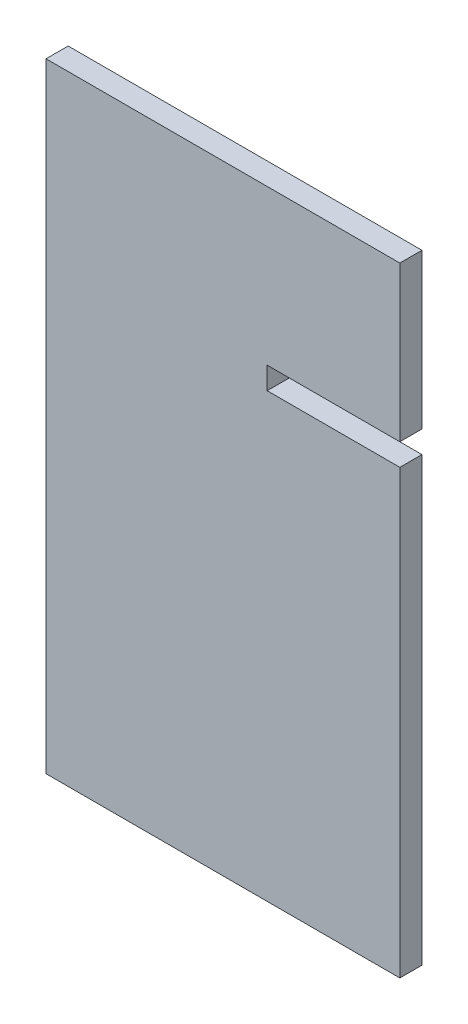
ISO-10303-21;
HEADER;
FILE_DESCRIPTION(('STEP AP214'),'2;1');
FILE_NAME('part.step','',(''),(''),'','','');
FILE_SCHEMA(('AUTOMOTIVE_DESIGN { 1 0 10303 214 1 1 1 1 }'));
ENDSEC;
DATA;
#1=APPLICATION_CONTEXT('core data for automotive mechanical design processes');
#2=APPLICATION_PROTOCOL_DEFINITION('international standard','automotive_design',2000,#1);
#3=PRODUCT_CONTEXT('',#1,'mechanical');
#4=PRODUCT('Part','Part','',(#3));
#5=PRODUCT_RELATED_PRODUCT_CATEGORY('part','',(#4));
#6=PRODUCT_DEFINITION_FORMATION('','',#4);
#7=PRODUCT_DEFINITION_CONTEXT('part definition',#1,'design');
#8=PRODUCT_DEFINITION('design','',#6,#7);
#9=PRODUCT_DEFINITION_SHAPE('','',#8);
#10=(LENGTH_UNIT() NAMED_UNIT(*) SI_UNIT(.MILLI.,.METRE.));
#11=(NAMED_UNIT(*) PLANE_ANGLE_UNIT() SI_UNIT($,.RADIAN.));
#12=(NAMED_UNIT(*) SI_UNIT($,.STERADIAN.) SOLID_ANGLE_UNIT());
#13=UNCERTAINTY_MEASURE_WITH_UNIT(LENGTH_MEASURE(1.E-05),#10,'distance_accuracy_value','');
#14=(GEOMETRIC_REPRESENTATION_CONTEXT(3) GLOBAL_UNCERTAINTY_ASSIGNED_CONTEXT((#13)) GLOBAL_UNIT_ASSIGNED_CONTEXT((#10,
#11,#12)) REPRESENTATION_CONTEXT('',''));
#15=CARTESIAN_POINT('',(0.,0.,0.));
#16=DIRECTION('',(0.,0.,1.));
#17=DIRECTION('',(1.,0.,0.));
#18=AXIS2_PLACEMENT_3D('',#15,#16,#17);
#19=CARTESIAN_POINT('',(0.,0.,5.));
#20=DIRECTION('',(1.,0.,0.));
#21=DIRECTION('',(0.,0.,-1.));
#22=AXIS2_PLACEMENT_3D('',#19,#20,#21);
#23=PLANE('',#22);
#24=DIRECTION('',(0.,-1.,0.));
#25=VECTOR('',#24,1.);
#26=CARTESIAN_POINT('',(0.,0.,0.));
#27=LINE('',#26,#25);
#28=CARTESIAN_POINT('',(0.,140.,0.));
#29=VERTEX_POINT('',#28);
#30=CARTESIAN_POINT('',(0.,0.,0.));
#31=VERTEX_POINT('',#30);
#32=EDGE_CURVE('E129',#29,#31,#27,.T.);
#33=ORIENTED_EDGE('',*,*,#32,.T.);
#34=DIRECTION('',(0.,0.,-1.));
#35=VECTOR('',#34,1.);
#36=CARTESIAN_POINT('',(0.,0.,5.));
#37=LINE('',#36,#35);
#38=CARTESIAN_POINT('',(0.,0.,5.));
#39=VERTEX_POINT('',#38);
#40=EDGE_CURVE('E11',#39,#31,#37,.T.);
#41=ORIENTED_EDGE('',*,*,#40,.F.);
#42=DIRECTION('',(0.,-1.,0.));
#43=VECTOR('',#42,1.);
#44=CARTESIAN_POINT('',(0.,0.,5.));
#45=LINE('',#44,#43);
#46=CARTESIAN_POINT('',(0.,140.,5.));
#47=VERTEX_POINT('',#46);
#48=EDGE_CURVE('E143',#47,#39,#45,.T.);
#49=ORIENTED_EDGE('',*,*,#48,.F.);
#50=DIRECTION('',(0.,0.,-1.));
#51=VECTOR('',#50,1.);
#52=CARTESIAN_POINT('',(0.,140.,5.));
#53=LINE('',#52,#51);
#54=EDGE_CURVE('E125',#47,#29,#53,.T.);
#55=ORIENTED_EDGE('',*,*,#54,.T.);
#56=EDGE_LOOP('',(#33,#41,#49,#55));
#57=FACE_BOUND('',#56,.T.);
#58=ADVANCED_FACE('F33',(#57),#23,.F.);
#59=CARTESIAN_POINT('',(0.,0.,5.));
#60=DIRECTION('',(0.,1.,0.));
#61=DIRECTION('',(0.,0.,1.));
#62=AXIS2_PLACEMENT_3D('',#59,#60,#61);
#63=PLANE('',#62);
#64=DIRECTION('',(1.,0.,0.));
#65=VECTOR('',#64,1.);
#66=CARTESIAN_POINT('',(0.,0.,0.));
#67=LINE('',#66,#65);
#68=CARTESIAN_POINT('',(80.,0.,0.));
#69=VERTEX_POINT('',#68);
#70=EDGE_CURVE('E132',#31,#69,#67,.T.);
#71=ORIENTED_EDGE('',*,*,#70,.T.);
#72=DIRECTION('',(0.,0.,-1.));
#73=VECTOR('',#72,1.);
#74=CARTESIAN_POINT('',(80.,0.,5.));
#75=LINE('',#74,#73);
#76=CARTESIAN_POINT('',(80.,0.,5.));
#77=VERTEX_POINT('',#76);
#78=EDGE_CURVE('E41',#77,#69,#75,.T.);
#79=ORIENTED_EDGE('',*,*,#78,.F.);
#80=DIRECTION('',(1.,0.,0.));
#81=VECTOR('',#80,1.);
#82=CARTESIAN_POINT('',(0.,0.,5.));
#83=LINE('',#82,#81);
#84=EDGE_CURVE('E92',#39,#77,#83,.T.);
#85=ORIENTED_EDGE('',*,*,#84,.F.);
#86=ORIENTED_EDGE('',*,*,#40,.T.);
#87=EDGE_LOOP('',(#71,#79,#85,#86));
#88=FACE_BOUND('',#87,.T.);
#89=ADVANCED_FACE('F178',(#88),#63,.F.);
#90=CARTESIAN_POINT('',(80.,100.,5.));
#91=DIRECTION('',(-1.,0.,0.));
#92=DIRECTION('',(0.,0.,1.));
#93=AXIS2_PLACEMENT_3D('',#90,#91,#92);
#94=PLANE('',#93);
#95=DIRECTION('',(0.,1.,0.));
#96=VECTOR('',#95,1.);
#97=CARTESIAN_POINT('',(80.,100.,0.));
#98=LINE('',#97,#96);
#99=CARTESIAN_POINT('',(80.,100.,0.));
#100=VERTEX_POINT('',#99);
#101=EDGE_CURVE('E134',#69,#100,#98,.T.);
#102=ORIENTED_EDGE('',*,*,#101,.T.);
#103=DIRECTION('',(0.,0.,-1.));
#104=VECTOR('',#103,1.);
#105=CARTESIAN_POINT('',(80.,100.,5.));
#106=LINE('',#105,#104);
#107=CARTESIAN_POINT('',(80.,100.,5.));
#108=VERTEX_POINT('',#107);
#109=EDGE_CURVE('E150',#108,#100,#106,.T.);
#110=ORIENTED_EDGE('',*,*,#109,.F.);
#111=DIRECTION('',(0.,1.,0.));
#112=VECTOR('',#111,1.);
#113=CARTESIAN_POINT('',(80.,100.,5.));
#114=LINE('',#113,#112);
#115=EDGE_CURVE('E158',#77,#108,#114,.T.);
#116=ORIENTED_EDGE('',*,*,#115,.F.);
#117=ORIENTED_EDGE('',*,*,#78,.T.);
#118=EDGE_LOOP('',(#102,#110,#116,#117));
#119=FACE_BOUND('',#118,.T.);
#120=ADVANCED_FACE('F156',(#119),#94,.F.);
#121=CARTESIAN_POINT('',(50.,100.,5.));
#122=DIRECTION('',(0.,-1.,0.));
#123=DIRECTION('',(0.,0.,-1.));
#124=AXIS2_PLACEMENT_3D('',#121,#122,#123);
#125=PLANE('',#124);
#126=DIRECTION('',(-1.,0.,0.));
#127=VECTOR('',#126,1.);
#128=CARTESIAN_POINT('',(50.,100.,0.));
#129=LINE('',#128,#127);
#130=CARTESIAN_POINT('',(50.,100.,0.));
#131=VERTEX_POINT('',#130);
#132=EDGE_CURVE('E136',#100,#131,#129,.T.);
#133=ORIENTED_EDGE('',*,*,#132,.T.);
#134=DIRECTION('',(0.,0.,-1.));
#135=VECTOR('',#134,1.);
#136=CARTESIAN_POINT('',(50.,100.,5.));
#137=LINE('',#136,#135);
#138=CARTESIAN_POINT('',(50.,100.,5.));
#139=VERTEX_POINT('',#138);
#140=EDGE_CURVE('E147',#139,#131,#137,.T.);
#141=ORIENTED_EDGE('',*,*,#140,.F.);
#142=DIRECTION('',(-1.,0.,0.));
#143=VECTOR('',#142,1.);
#144=CARTESIAN_POINT('',(50.,100.,5.));
#145=LINE('',#144,#143);
#146=EDGE_CURVE('E170',#108,#139,#145,.T.);
#147=ORIENTED_EDGE('',*,*,#146,.F.);
#148=ORIENTED_EDGE('',*,*,#109,.T.);
#149=EDGE_LOOP('',(#133,#141,#147,#148));
#150=FACE_BOUND('',#149,.T.);
#151=ADVANCED_FACE('F166',(#150),#125,.F.);
#152=CARTESIAN_POINT('',(50.,105.,5.));
#153=DIRECTION('',(-1.,0.,0.));
#154=DIRECTION('',(0.,-1.,0.));
#155=AXIS2_PLACEMENT_3D('',#152,#153,#154);
#156=PLANE('',#155);
#157=DIRECTION('',(0.,1.,0.));
#158=VECTOR('',#157,1.);
#159=CARTESIAN_POINT('',(50.,105.,0.));
#160=LINE('',#159,#158);
#161=CARTESIAN_POINT('',(50.,105.,0.));
#162=VERTEX_POINT('',#161);
#163=EDGE_CURVE('E138',#131,#162,#160,.T.);
#164=ORIENTED_EDGE('',*,*,#163,.T.);
#165=DIRECTION('',(0.,0.,-1.));
#166=VECTOR('',#165,1.);
#167=CARTESIAN_POINT('',(50.,105.,5.));
#168=LINE('',#167,#166);
#169=CARTESIAN_POINT('',(50.,105.,5.));
#170=VERTEX_POINT('',#169);
#171=EDGE_CURVE('E120',#170,#162,#168,.T.);
#172=ORIENTED_EDGE('',*,*,#171,.F.);
#173=DIRECTION('',(0.,1.,0.));
#174=VECTOR('',#173,1.);
#175=CARTESIAN_POINT('',(50.,105.,5.));
#176=LINE('',#175,#174);
#177=EDGE_CURVE('E111',#139,#170,#176,.T.);
#178=ORIENTED_EDGE('',*,*,#177,.F.);
#179=ORIENTED_EDGE('',*,*,#140,.T.);
#180=EDGE_LOOP('',(#164,#172,#178,#179));
#181=FACE_BOUND('',#180,.T.);
#182=ADVANCED_FACE('F169',(#181),#156,.F.);
#183=CARTESIAN_POINT('',(50.,105.,5.));
#184=DIRECTION('',(0.,1.,0.));
#185=DIRECTION('',(0.,0.,1.));
#186=AXIS2_PLACEMENT_3D('',#183,#184,#185);
#187=PLANE('',#186);
#188=DIRECTION('',(1.,0.,0.));
#189=VECTOR('',#188,1.);
#190=CARTESIAN_POINT('',(50.,105.,0.));
#191=LINE('',#190,#189);
#192=CARTESIAN_POINT('',(80.,105.,0.));
#193=VERTEX_POINT('',#192);
#194=EDGE_CURVE('E119',#162,#193,#191,.T.);
#195=ORIENTED_EDGE('',*,*,#194,.T.);
#196=DIRECTION('',(0.,0.,-1.));
#197=VECTOR('',#196,1.);
#198=CARTESIAN_POINT('',(80.,105.,5.));
#199=LINE('',#198,#197);
#200=CARTESIAN_POINT('',(80.,105.,5.));
#201=VERTEX_POINT('',#200);
#202=EDGE_CURVE('E116',#201,#193,#199,.T.);
#203=ORIENTED_EDGE('',*,*,#202,.F.);
#204=DIRECTION('',(1.,0.,0.));
#205=VECTOR('',#204,1.);
#206=CARTESIAN_POINT('',(50.,105.,5.));
#207=LINE('',#206,#205);
#208=EDGE_CURVE('E105',#170,#201,#207,.T.);
#209=ORIENTED_EDGE('',*,*,#208,.F.);
#210=ORIENTED_EDGE('',*,*,#171,.T.);
#211=EDGE_LOOP('',(#195,#203,#209,#210));
#212=FACE_BOUND('',#211,.T.);
#213=ADVANCED_FACE('F117',(#212),#187,.F.);
#214=CARTESIAN_POINT('',(80.,140.,5.));
#215=DIRECTION('',(-1.,0.,0.));
#216=DIRECTION('',(0.,-1.,0.));
#217=AXIS2_PLACEMENT_3D('',#214,#215,#216);
#218=PLANE('',#217);
#219=DIRECTION('',(0.,1.,0.));
#220=VECTOR('',#219,1.);
#221=CARTESIAN_POINT('',(80.,140.,0.));
#222=LINE('',#221,#220);
#223=CARTESIAN_POINT('',(80.,140.,0.));
#224=VERTEX_POINT('',#223);
#225=EDGE_CURVE('E78',#193,#224,#222,.T.);
#226=ORIENTED_EDGE('',*,*,#225,.T.);
#227=DIRECTION('',(0.,0.,-1.));
#228=VECTOR('',#227,1.);
#229=CARTESIAN_POINT('',(80.,140.,5.));
#230=LINE('',#229,#228);
#231=CARTESIAN_POINT('',(80.,140.,5.));
#232=VERTEX_POINT('',#231);
#233=EDGE_CURVE('E121',#232,#224,#230,.T.);
#234=ORIENTED_EDGE('',*,*,#233,.F.);
#235=DIRECTION('',(0.,1.,0.));
#236=VECTOR('',#235,1.);
#237=CARTESIAN_POINT('',(80.,140.,5.));
#238=LINE('',#237,#236);
#239=EDGE_CURVE('E109',#201,#232,#238,.T.);
#240=ORIENTED_EDGE('',*,*,#239,.F.);
#241=ORIENTED_EDGE('',*,*,#202,.T.);
#242=EDGE_LOOP('',(#226,#234,#240,#241));
#243=FACE_BOUND('',#242,.T.);
#244=ADVANCED_FACE('F123',(#243),#218,.F.);
#245=CARTESIAN_POINT('',(0.,140.,5.));
#246=DIRECTION('',(0.,-1.,0.));
#247=DIRECTION('',(0.,0.,-1.));
#248=AXIS2_PLACEMENT_3D('',#245,#246,#247);
#249=PLANE('',#248);
#250=DIRECTION('',(-1.,0.,0.));
#251=VECTOR('',#250,1.);
#252=CARTESIAN_POINT('',(0.,140.,0.));
#253=LINE('',#252,#251);
#254=EDGE_CURVE('E84',#224,#29,#253,.T.);
#255=ORIENTED_EDGE('',*,*,#254,.T.);
#256=ORIENTED_EDGE('',*,*,#54,.F.);
#257=DIRECTION('',(-1.,0.,0.));
#258=VECTOR('',#257,1.);
#259=CARTESIAN_POINT('',(0.,140.,5.));
#260=LINE('',#259,#258);
#261=EDGE_CURVE('E49',#232,#47,#260,.T.);
#262=ORIENTED_EDGE('',*,*,#261,.F.);
#263=ORIENTED_EDGE('',*,*,#233,.T.);
#264=EDGE_LOOP('',(#255,#256,#262,#263));
#265=FACE_BOUND('',#264,.T.);
#266=ADVANCED_FACE('F194',(#265),#249,.F.);
#267=CARTESIAN_POINT('',(0.,0.,5.));
#268=DIRECTION('',(0.,0.,-1.));
#269=DIRECTION('',(-1.,0.,0.));
#270=AXIS2_PLACEMENT_3D('',#267,#268,#269);
#271=PLANE('',#270);
#272=ORIENTED_EDGE('',*,*,#48,.T.);
#273=ORIENTED_EDGE('',*,*,#84,.T.);
#274=ORIENTED_EDGE('',*,*,#115,.T.);
#275=ORIENTED_EDGE('',*,*,#146,.T.);
#276=ORIENTED_EDGE('',*,*,#177,.T.);
#277=ORIENTED_EDGE('',*,*,#208,.T.);
#278=ORIENTED_EDGE('',*,*,#239,.T.);
#279=ORIENTED_EDGE('',*,*,#261,.T.);
#280=EDGE_LOOP('',(#272,#273,#274,#275,#276,#277,#278,#279));
#281=FACE_BOUND('',#280,.T.);
#282=ADVANCED_FACE('F107',(#281),#271,.F.);
#283=CARTESIAN_POINT('',(0.,0.,0.));
#284=DIRECTION('',(0.,0.,-1.));
#285=DIRECTION('',(-1.,0.,0.));
#286=AXIS2_PLACEMENT_3D('',#283,#284,#285);
#287=PLANE('',#286);
#288=ORIENTED_EDGE('',*,*,#32,.F.);
#289=ORIENTED_EDGE('',*,*,#254,.F.);
#290=ORIENTED_EDGE('',*,*,#225,.F.);
#291=ORIENTED_EDGE('',*,*,#194,.F.);
#292=ORIENTED_EDGE('',*,*,#163,.F.);
#293=ORIENTED_EDGE('',*,*,#132,.F.);
#294=ORIENTED_EDGE('',*,*,#101,.F.);
#295=ORIENTED_EDGE('',*,*,#70,.F.);
#296=EDGE_LOOP('',(#288,#289,#290,#291,#292,#293,#294,#295));
#297=FACE_BOUND('',#296,.T.);
#298=ADVANCED_FACE('F162',(#297),#287,.T.);
#299=CLOSED_SHELL('',(#58,#89,#120,#151,#182,#213,#244,#266,#282,#298));
#300=MANIFOLD_SOLID_BREP('B2',#299);
#301=ADVANCED_BREP_SHAPE_REPRESENTATION('',(#18,#300),#14);
#302=SHAPE_DEFINITION_REPRESENTATION(#9,#301);
ENDSEC;
END-ISO-10303-21;
